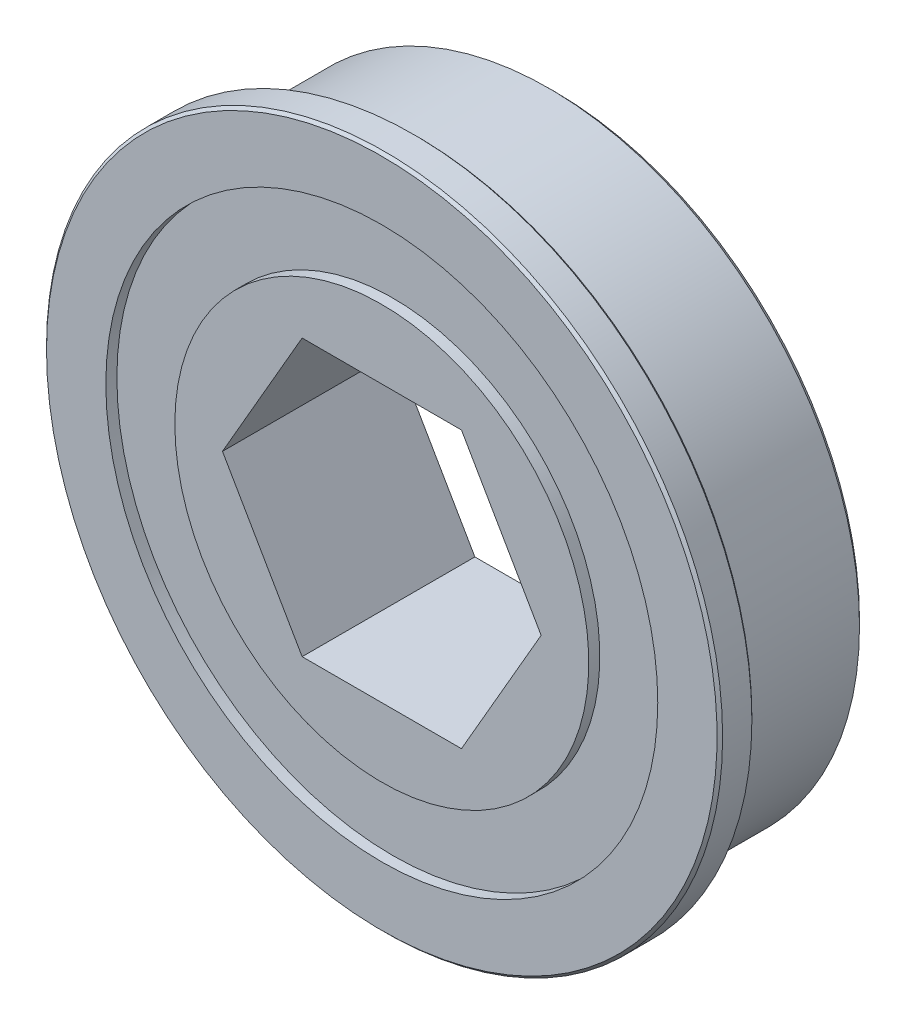
ISO-10303-21;
HEADER;
FILE_DESCRIPTION(('STEP AP214'),'2;1');
FILE_NAME('part.step','',(''),(''),'','','');
FILE_SCHEMA(('AUTOMOTIVE_DESIGN { 1 0 10303 214 1 1 1 1 }'));
ENDSEC;
DATA;
#1=APPLICATION_CONTEXT('core data for automotive mechanical design processes');
#2=APPLICATION_PROTOCOL_DEFINITION('international standard','automotive_design',2000,#1);
#3=PRODUCT_CONTEXT('',#1,'mechanical');
#4=PRODUCT('Part','Part','',(#3));
#5=PRODUCT_RELATED_PRODUCT_CATEGORY('part','',(#4));
#6=PRODUCT_DEFINITION_FORMATION('','',#4);
#7=PRODUCT_DEFINITION_CONTEXT('part definition',#1,'design');
#8=PRODUCT_DEFINITION('design','',#6,#7);
#9=PRODUCT_DEFINITION_SHAPE('','',#8);
#10=(LENGTH_UNIT() NAMED_UNIT(*) SI_UNIT(.MILLI.,.METRE.));
#11=(NAMED_UNIT(*) PLANE_ANGLE_UNIT() SI_UNIT($,.RADIAN.));
#12=(NAMED_UNIT(*) SI_UNIT($,.STERADIAN.) SOLID_ANGLE_UNIT());
#13=UNCERTAINTY_MEASURE_WITH_UNIT(LENGTH_MEASURE(1.E-05),#10,'distance_accuracy_value','');
#14=(GEOMETRIC_REPRESENTATION_CONTEXT(3) GLOBAL_UNCERTAINTY_ASSIGNED_CONTEXT((#13)) GLOBAL_UNIT_ASSIGNED_CONTEXT((#10,
#11,#12)) REPRESENTATION_CONTEXT('',''));
#15=CARTESIAN_POINT('',(0.,0.,0.));
#16=DIRECTION('',(0.,0.,1.));
#17=DIRECTION('',(1.,0.,0.));
#18=AXIS2_PLACEMENT_3D('',#15,#16,#17);
#19=CARTESIAN_POINT('',(7.33234841870825,0.,-3.975));
#20=DIRECTION('',(0.866025403784439,0.5,0.));
#21=DIRECTION('',(0.,0.,-1.));
#22=AXIS2_PLACEMENT_3D('',#19,#20,#21);
#23=PLANE('',#22);
#24=DIRECTION('',(-0.5,0.866025403784439,0.));
#25=VECTOR('',#24,1.);
#26=CARTESIAN_POINT('',(7.33234841870825,0.,3.975));
#27=LINE('',#26,#25);
#28=CARTESIAN_POINT('',(7.33234841870825,0.,3.975));
#29=VERTEX_POINT('',#28);
#30=CARTESIAN_POINT('',(3.66617420935412,6.35,3.975));
#31=VERTEX_POINT('',#30);
#32=EDGE_CURVE('E191',#29,#31,#27,.T.);
#33=ORIENTED_EDGE('',*,*,#32,.T.);
#34=DIRECTION('',(0.,0.,1.));
#35=VECTOR('',#34,1.);
#36=CARTESIAN_POINT('',(3.66617420935412,6.35,-3.975));
#37=LINE('',#36,#35);
#38=CARTESIAN_POINT('',(3.66617420935412,6.35,-3.975));
#39=VERTEX_POINT('',#38);
#40=EDGE_CURVE('E12',#39,#31,#37,.T.);
#41=ORIENTED_EDGE('',*,*,#40,.F.);
#42=DIRECTION('',(-0.5,0.866025403784439,0.));
#43=VECTOR('',#42,1.);
#44=CARTESIAN_POINT('',(7.33234841870825,0.,-3.975));
#45=LINE('',#44,#43);
#46=CARTESIAN_POINT('',(7.33234841870825,0.,-3.975));
#47=VERTEX_POINT('',#46);
#48=EDGE_CURVE('E116',#47,#39,#45,.T.);
#49=ORIENTED_EDGE('',*,*,#48,.F.);
#50=DIRECTION('',(0.,0.,1.));
#51=VECTOR('',#50,1.);
#52=CARTESIAN_POINT('',(7.33234841870825,0.,-3.975));
#53=LINE('',#52,#51);
#54=EDGE_CURVE('E91',#47,#29,#53,.T.);
#55=ORIENTED_EDGE('',*,*,#54,.T.);
#56=EDGE_LOOP('',(#33,#41,#49,#55));
#57=FACE_BOUND('',#56,.T.);
#58=ADVANCED_FACE('F20',(#57),#23,.F.);
#59=CARTESIAN_POINT('',(3.66617420935412,6.35,-3.975));
#60=DIRECTION('',(0.,1.,0.));
#61=DIRECTION('',(1.,0.,0.));
#62=AXIS2_PLACEMENT_3D('',#59,#60,#61);
#63=PLANE('',#62);
#64=DIRECTION('',(-1.,0.,0.));
#65=VECTOR('',#64,1.);
#66=CARTESIAN_POINT('',(3.66617420935412,6.35,3.975));
#67=LINE('',#66,#65);
#68=CARTESIAN_POINT('',(-3.66617420935412,6.35,3.975));
#69=VERTEX_POINT('',#68);
#70=EDGE_CURVE('E124',#31,#69,#67,.T.);
#71=ORIENTED_EDGE('',*,*,#70,.T.);
#72=DIRECTION('',(0.,0.,1.));
#73=VECTOR('',#72,1.);
#74=CARTESIAN_POINT('',(-3.66617420935412,6.35,-3.975));
#75=LINE('',#74,#73);
#76=CARTESIAN_POINT('',(-3.66617420935412,6.35,-3.975));
#77=VERTEX_POINT('',#76);
#78=EDGE_CURVE('E28',#77,#69,#75,.T.);
#79=ORIENTED_EDGE('',*,*,#78,.F.);
#80=DIRECTION('',(-1.,0.,0.));
#81=VECTOR('',#80,1.);
#82=CARTESIAN_POINT('',(3.66617420935412,6.35,-3.975));
#83=LINE('',#82,#81);
#84=EDGE_CURVE('E211',#39,#77,#83,.T.);
#85=ORIENTED_EDGE('',*,*,#84,.F.);
#86=ORIENTED_EDGE('',*,*,#40,.T.);
#87=EDGE_LOOP('',(#71,#79,#85,#86));
#88=FACE_BOUND('',#87,.T.);
#89=ADVANCED_FACE('F238',(#88),#63,.F.);
#90=CARTESIAN_POINT('',(-3.66617420935412,6.35,-3.975));
#91=DIRECTION('',(-0.866025403784439,0.5,0.));
#92=DIRECTION('',(0.,0.,1.));
#93=AXIS2_PLACEMENT_3D('',#90,#91,#92);
#94=PLANE('',#93);
#95=DIRECTION('',(-0.5,-0.866025403784439,0.));
#96=VECTOR('',#95,1.);
#97=CARTESIAN_POINT('',(-3.66617420935412,6.35,3.975));
#98=LINE('',#97,#96);
#99=CARTESIAN_POINT('',(-7.33234841870825,0.,3.975));
#100=VERTEX_POINT('',#99);
#101=EDGE_CURVE('E129',#69,#100,#98,.T.);
#102=ORIENTED_EDGE('',*,*,#101,.T.);
#103=DIRECTION('',(0.,0.,1.));
#104=VECTOR('',#103,1.);
#105=CARTESIAN_POINT('',(-7.33234841870825,0.,-3.975));
#106=LINE('',#105,#104);
#107=CARTESIAN_POINT('',(-7.33234841870825,0.,-3.975));
#108=VERTEX_POINT('',#107);
#109=EDGE_CURVE('E41',#108,#100,#106,.T.);
#110=ORIENTED_EDGE('',*,*,#109,.F.);
#111=DIRECTION('',(-0.5,-0.866025403784439,0.));
#112=VECTOR('',#111,1.);
#113=CARTESIAN_POINT('',(-3.66617420935412,6.35,-3.975));
#114=LINE('',#113,#112);
#115=EDGE_CURVE('E216',#77,#108,#114,.T.);
#116=ORIENTED_EDGE('',*,*,#115,.F.);
#117=ORIENTED_EDGE('',*,*,#78,.T.);
#118=EDGE_LOOP('',(#102,#110,#116,#117));
#119=FACE_BOUND('',#118,.T.);
#120=ADVANCED_FACE('F234',(#119),#94,.F.);
#121=CARTESIAN_POINT('',(-7.33234841870825,0.,-3.975));
#122=DIRECTION('',(-0.866025403784439,-0.5,0.));
#123=DIRECTION('',(-0.5,0.866025403784439,0.));
#124=AXIS2_PLACEMENT_3D('',#121,#122,#123);
#125=PLANE('',#124);
#126=DIRECTION('',(0.5,-0.866025403784439,0.));
#127=VECTOR('',#126,1.);
#128=CARTESIAN_POINT('',(-7.33234841870825,0.,3.975));
#129=LINE('',#128,#127);
#130=CARTESIAN_POINT('',(-3.66617420935412,-6.35,3.975));
#131=VERTEX_POINT('',#130);
#132=EDGE_CURVE('E203',#100,#131,#129,.T.);
#133=ORIENTED_EDGE('',*,*,#132,.T.);
#134=DIRECTION('',(0.,0.,1.));
#135=VECTOR('',#134,1.);
#136=CARTESIAN_POINT('',(-3.66617420935412,-6.35,-3.975));
#137=LINE('',#136,#135);
#138=CARTESIAN_POINT('',(-3.66617420935412,-6.35,-3.975));
#139=VERTEX_POINT('',#138);
#140=EDGE_CURVE('E108',#139,#131,#137,.T.);
#141=ORIENTED_EDGE('',*,*,#140,.F.);
#142=DIRECTION('',(0.5,-0.866025403784439,0.));
#143=VECTOR('',#142,1.);
#144=CARTESIAN_POINT('',(-7.33234841870825,0.,-3.975));
#145=LINE('',#144,#143);
#146=EDGE_CURVE('E122',#108,#139,#145,.T.);
#147=ORIENTED_EDGE('',*,*,#146,.F.);
#148=ORIENTED_EDGE('',*,*,#109,.T.);
#149=EDGE_LOOP('',(#133,#141,#147,#148));
#150=FACE_BOUND('',#149,.T.);
#151=ADVANCED_FACE('F666',(#150),#125,.F.);
#152=CARTESIAN_POINT('',(-3.66617420935412,-6.35,-3.975));
#153=DIRECTION('',(0.,-1.,0.));
#154=DIRECTION('',(0.,0.,-1.));
#155=AXIS2_PLACEMENT_3D('',#152,#153,#154);
#156=PLANE('',#155);
#157=DIRECTION('',(1.,0.,0.));
#158=VECTOR('',#157,1.);
#159=CARTESIAN_POINT('',(-3.66617420935412,-6.35,3.975));
#160=LINE('',#159,#158);
#161=CARTESIAN_POINT('',(3.66617420935412,-6.35,3.975));
#162=VERTEX_POINT('',#161);
#163=EDGE_CURVE('E105',#131,#162,#160,.T.);
#164=ORIENTED_EDGE('',*,*,#163,.T.);
#165=DIRECTION('',(0.,0.,1.));
#166=VECTOR('',#165,1.);
#167=CARTESIAN_POINT('',(3.66617420935412,-6.35,-3.975));
#168=LINE('',#167,#166);
#169=CARTESIAN_POINT('',(3.66617420935412,-6.35,-3.975));
#170=VERTEX_POINT('',#169);
#171=EDGE_CURVE('E100',#170,#162,#168,.T.);
#172=ORIENTED_EDGE('',*,*,#171,.F.);
#173=DIRECTION('',(1.,0.,0.));
#174=VECTOR('',#173,1.);
#175=CARTESIAN_POINT('',(-3.66617420935412,-6.35,-3.975));
#176=LINE('',#175,#174);
#177=EDGE_CURVE('E103',#139,#170,#176,.T.);
#178=ORIENTED_EDGE('',*,*,#177,.F.);
#179=ORIENTED_EDGE('',*,*,#140,.T.);
#180=EDGE_LOOP('',(#164,#172,#178,#179));
#181=FACE_BOUND('',#180,.T.);
#182=ADVANCED_FACE('F101',(#181),#156,.F.);
#183=CARTESIAN_POINT('',(3.66617420935412,-6.35,-3.975));
#184=DIRECTION('',(0.866025403784439,-0.5,0.));
#185=DIRECTION('',(0.,0.,-1.));
#186=AXIS2_PLACEMENT_3D('',#183,#184,#185);
#187=PLANE('',#186);
#188=DIRECTION('',(0.5,0.866025403784439,0.));
#189=VECTOR('',#188,1.);
#190=CARTESIAN_POINT('',(3.66617420935412,-6.35,3.975));
#191=LINE('',#190,#189);
#192=EDGE_CURVE('E195',#162,#29,#191,.T.);
#193=ORIENTED_EDGE('',*,*,#192,.T.);
#194=ORIENTED_EDGE('',*,*,#54,.F.);
#195=DIRECTION('',(0.5,0.866025403784439,0.));
#196=VECTOR('',#195,1.);
#197=CARTESIAN_POINT('',(3.66617420935412,-6.35,-3.975));
#198=LINE('',#197,#196);
#199=EDGE_CURVE('E111',#170,#47,#198,.T.);
#200=ORIENTED_EDGE('',*,*,#199,.F.);
#201=ORIENTED_EDGE('',*,*,#171,.T.);
#202=EDGE_LOOP('',(#193,#194,#200,#201));
#203=FACE_BOUND('',#202,.T.);
#204=ADVANCED_FACE('F112',(#203),#187,.F.);
#205=CARTESIAN_POINT('',(0.,0.,3.467));
#206=DIRECTION('',(0.,0.,1.));
#207=DIRECTION('',(1.,0.,0.));
#208=AXIS2_PLACEMENT_3D('',#205,#206,#207);
#209=PLANE('',#208);
#210=CARTESIAN_POINT('',(0.,0.,3.467));
#211=DIRECTION('',(0.,0.,-1.));
#212=DIRECTION('',(-1.,0.,0.));
#213=AXIS2_PLACEMENT_3D('',#210,#211,#212);
#214=CIRCLE('',#213,9.525);
#215=CARTESIAN_POINT('',(-9.525,0.,3.467));
#216=VERTEX_POINT('',#215);
#217=EDGE_CURVE('E170',#216,#216,#214,.T.);
#218=ORIENTED_EDGE('',*,*,#217,.T.);
#219=EDGE_LOOP('',(#218));
#220=FACE_BOUND('',#219,.T.);
#221=CARTESIAN_POINT('',(0.,0.,3.467));
#222=DIRECTION('',(0.,0.,-1.));
#223=DIRECTION('',(-1.,0.,0.));
#224=AXIS2_PLACEMENT_3D('',#221,#222,#223);
#225=CIRCLE('',#224,12.7);
#226=CARTESIAN_POINT('',(-12.7,0.,3.467));
#227=VERTEX_POINT('',#226);
#228=EDGE_CURVE('E152',#227,#227,#225,.T.);
#229=ORIENTED_EDGE('',*,*,#228,.F.);
#230=EDGE_LOOP('',(#229));
#231=FACE_BOUND('',#230,.T.);
#232=ADVANCED_FACE('F631',(#220,#231),#209,.T.);
#233=CARTESIAN_POINT('',(0.,0.,-3.467));
#234=DIRECTION('',(0.,0.,-1.));
#235=DIRECTION('',(0.,-1.,0.));
#236=AXIS2_PLACEMENT_3D('',#233,#234,#235);
#237=PLANE('',#236);
#238=CARTESIAN_POINT('',(0.,0.,-3.467));
#239=DIRECTION('',(0.,0.,-1.));
#240=DIRECTION('',(-1.,0.,0.));
#241=AXIS2_PLACEMENT_3D('',#238,#239,#240);
#242=CIRCLE('',#241,9.525);
#243=CARTESIAN_POINT('',(-9.525,0.,-3.467));
#244=VERTEX_POINT('',#243);
#245=EDGE_CURVE('E296',#244,#244,#242,.T.);
#246=ORIENTED_EDGE('',*,*,#245,.F.);
#247=EDGE_LOOP('',(#246));
#248=FACE_BOUND('',#247,.T.);
#249=CARTESIAN_POINT('',(0.,0.,-3.467));
#250=DIRECTION('',(0.,0.,-1.));
#251=DIRECTION('',(-1.,0.,0.));
#252=AXIS2_PLACEMENT_3D('',#249,#250,#251);
#253=CIRCLE('',#252,12.7);
#254=CARTESIAN_POINT('',(-12.7,0.,-3.467));
#255=VERTEX_POINT('',#254);
#256=EDGE_CURVE('E180',#255,#255,#253,.T.);
#257=ORIENTED_EDGE('',*,*,#256,.T.);
#258=EDGE_LOOP('',(#257));
#259=FACE_BOUND('',#258,.T.);
#260=ADVANCED_FACE('F619',(#248,#259),#237,.T.);
#261=CARTESIAN_POINT('',(0.,14.2875,2.375));
#262=DIRECTION('',(0.,0.,1.));
#263=DIRECTION('',(1.,0.,0.));
#264=AXIS2_PLACEMENT_3D('',#261,#262,#263);
#265=PLANE('',#264);
#266=CARTESIAN_POINT('',(0.,0.,2.375));
#267=DIRECTION('',(0.,0.,1.));
#268=DIRECTION('',(1.,0.,0.));
#269=AXIS2_PLACEMENT_3D('',#266,#267,#268);
#270=CIRCLE('',#269,14.1605);
#271=CARTESIAN_POINT('',(14.1605,0.,2.375));
#272=VERTEX_POINT('',#271);
#273=EDGE_CURVE('E134',#272,#272,#270,.T.);
#274=ORIENTED_EDGE('',*,*,#273,.T.);
#275=EDGE_LOOP('',(#274));
#276=FACE_BOUND('',#275,.T.);
#277=CARTESIAN_POINT('',(0.,0.,2.375));
#278=DIRECTION('',(0.,0.,-1.));
#279=DIRECTION('',(1.,0.,0.));
#280=AXIS2_PLACEMENT_3D('',#277,#278,#279);
#281=CIRCLE('',#280,15.4305);
#282=CARTESIAN_POINT('',(15.4305,0.,2.375));
#283=VERTEX_POINT('',#282);
#284=EDGE_CURVE('E335',#283,#283,#281,.T.);
#285=ORIENTED_EDGE('',*,*,#284,.T.);
#286=EDGE_LOOP('',(#285));
#287=FACE_BOUND('',#286,.T.);
#288=ADVANCED_FACE('F607',(#276,#287),#265,.F.);
#289=CARTESIAN_POINT('',(0.,14.1605,2.121));
#290=DIRECTION('',(0.,0.,-1.));
#291=DIRECTION('',(0.,-1.,0.));
#292=AXIS2_PLACEMENT_3D('',#289,#290,#291);
#293=PLANE('',#292);
#294=CARTESIAN_POINT('',(0.,0.,2.121));
#295=DIRECTION('',(0.,0.,1.));
#296=DIRECTION('',(1.,0.,0.));
#297=AXIS2_PLACEMENT_3D('',#294,#295,#296);
#298=CIRCLE('',#297,14.1605);
#299=CARTESIAN_POINT('',(14.1605,0.,2.121));
#300=VERTEX_POINT('',#299);
#301=EDGE_CURVE('E272',#300,#300,#298,.T.);
#302=ORIENTED_EDGE('',*,*,#301,.F.);
#303=EDGE_LOOP('',(#302));
#304=FACE_BOUND('',#303,.T.);
#305=CARTESIAN_POINT('',(0.,0.,2.121));
#306=DIRECTION('',(0.,0.,1.));
#307=DIRECTION('',(1.,0.,0.));
#308=AXIS2_PLACEMENT_3D('',#305,#306,#307);
#309=CIRCLE('',#308,14.2875);
#310=CARTESIAN_POINT('',(14.2875,0.,2.121));
#311=VERTEX_POINT('',#310);
#312=EDGE_CURVE('E137',#311,#311,#309,.T.);
#313=ORIENTED_EDGE('',*,*,#312,.T.);
#314=EDGE_LOOP('',(#313));
#315=FACE_BOUND('',#314,.T.);
#316=ADVANCED_FACE('F503',(#304,#315),#293,.F.);
#317=CARTESIAN_POINT('',(0.,5.08,-3.975));
#318=DIRECTION('',(0.,0.,1.));
#319=DIRECTION('',(1.,0.,0.));
#320=AXIS2_PLACEMENT_3D('',#317,#318,#319);
#321=PLANE('',#320);
#322=CARTESIAN_POINT('',(0.,0.,-3.975));
#323=DIRECTION('',(0.,0.,-1.));
#324=DIRECTION('',(-1.,0.,0.));
#325=AXIS2_PLACEMENT_3D('',#322,#323,#324);
#326=CIRCLE('',#325,12.7);
#327=CARTESIAN_POINT('',(-12.7,0.,-3.975));
#328=VERTEX_POINT('',#327);
#329=EDGE_CURVE('E278',#328,#328,#326,.T.);
#330=ORIENTED_EDGE('',*,*,#329,.F.);
#331=EDGE_LOOP('',(#330));
#332=FACE_BOUND('',#331,.T.);
#333=CARTESIAN_POINT('',(0.,0.,-3.975));
#334=DIRECTION('',(0.,0.,-1.));
#335=DIRECTION('',(1.,0.,0.));
#336=AXIS2_PLACEMENT_3D('',#333,#334,#335);
#337=CIRCLE('',#336,14.0335);
#338=CARTESIAN_POINT('',(14.0335,0.,-3.975));
#339=VERTEX_POINT('',#338);
#340=EDGE_CURVE('E323',#339,#339,#337,.T.);
#341=ORIENTED_EDGE('',*,*,#340,.T.);
#342=EDGE_LOOP('',(#341));
#343=FACE_BOUND('',#342,.T.);
#344=ADVANCED_FACE('F497',(#332,#343),#321,.F.);
#345=CARTESIAN_POINT('',(0.,15.5575,3.975));
#346=DIRECTION('',(0.,0.,-1.));
#347=DIRECTION('',(0.,-1.,0.));
#348=AXIS2_PLACEMENT_3D('',#345,#346,#347);
#349=PLANE('',#348);
#350=CARTESIAN_POINT('',(0.,0.,3.975));
#351=DIRECTION('',(0.,0.,-1.));
#352=DIRECTION('',(-1.,0.,0.));
#353=AXIS2_PLACEMENT_3D('',#350,#351,#352);
#354=CIRCLE('',#353,12.7);
#355=CARTESIAN_POINT('',(-12.7,0.,3.975));
#356=VERTEX_POINT('',#355);
#357=EDGE_CURVE('E157',#356,#356,#354,.T.);
#358=ORIENTED_EDGE('',*,*,#357,.T.);
#359=EDGE_LOOP('',(#358));
#360=FACE_BOUND('',#359,.T.);
#361=CARTESIAN_POINT('',(0.,0.,3.975));
#362=DIRECTION('',(0.,0.,1.));
#363=DIRECTION('',(-1.,0.,0.));
#364=AXIS2_PLACEMENT_3D('',#361,#362,#363);
#365=CIRCLE('',#364,15.4305);
#366=CARTESIAN_POINT('',(-15.4305,0.,3.975));
#367=VERTEX_POINT('',#366);
#368=EDGE_CURVE('E175',#367,#367,#365,.T.);
#369=ORIENTED_EDGE('',*,*,#368,.T.);
#370=EDGE_LOOP('',(#369));
#371=FACE_BOUND('',#370,.T.);
#372=ADVANCED_FACE('F502',(#360,#371),#349,.F.);
#373=CARTESIAN_POINT('',(0.,5.08,-3.975));
#374=DIRECTION('',(0.,0.,1.));
#375=DIRECTION('',(1.,0.,0.));
#376=AXIS2_PLACEMENT_3D('',#373,#374,#375);
#377=PLANE('',#376);
#378=ORIENTED_EDGE('',*,*,#177,.T.);
#379=ORIENTED_EDGE('',*,*,#199,.T.);
#380=ORIENTED_EDGE('',*,*,#48,.T.);
#381=ORIENTED_EDGE('',*,*,#84,.T.);
#382=ORIENTED_EDGE('',*,*,#115,.T.);
#383=ORIENTED_EDGE('',*,*,#146,.T.);
#384=EDGE_LOOP('',(#378,#379,#380,#381,#382,#383));
#385=FACE_BOUND('',#384,.T.);
#386=CARTESIAN_POINT('',(0.,0.,-3.975));
#387=DIRECTION('',(0.,0.,-1.));
#388=DIRECTION('',(-1.,0.,0.));
#389=AXIS2_PLACEMENT_3D('',#386,#387,#388);
#390=CIRCLE('',#389,9.525);
#391=CARTESIAN_POINT('',(-9.525,0.,-3.975));
#392=VERTEX_POINT('',#391);
#393=EDGE_CURVE('E290',#392,#392,#390,.T.);
#394=ORIENTED_EDGE('',*,*,#393,.T.);
#395=EDGE_LOOP('',(#394));
#396=FACE_BOUND('',#395,.T.);
#397=ADVANCED_FACE('F119',(#385,#396),#377,.F.);
#398=CARTESIAN_POINT('',(0.,15.5575,3.975));
#399=DIRECTION('',(0.,0.,-1.));
#400=DIRECTION('',(0.,-1.,0.));
#401=AXIS2_PLACEMENT_3D('',#398,#399,#400);
#402=PLANE('',#401);
#403=ORIENTED_EDGE('',*,*,#32,.F.);
#404=ORIENTED_EDGE('',*,*,#192,.F.);
#405=ORIENTED_EDGE('',*,*,#163,.F.);
#406=ORIENTED_EDGE('',*,*,#132,.F.);
#407=ORIENTED_EDGE('',*,*,#101,.F.);
#408=ORIENTED_EDGE('',*,*,#70,.F.);
#409=EDGE_LOOP('',(#403,#404,#405,#406,#407,#408));
#410=FACE_BOUND('',#409,.T.);
#411=CARTESIAN_POINT('',(0.,0.,3.975));
#412=DIRECTION('',(0.,0.,-1.));
#413=DIRECTION('',(-1.,0.,0.));
#414=AXIS2_PLACEMENT_3D('',#411,#412,#413);
#415=CIRCLE('',#414,9.525);
#416=CARTESIAN_POINT('',(-9.525,0.,3.975));
#417=VERTEX_POINT('',#416);
#418=EDGE_CURVE('E158',#417,#417,#415,.T.);
#419=ORIENTED_EDGE('',*,*,#418,.F.);
#420=EDGE_LOOP('',(#419));
#421=FACE_BOUND('',#420,.T.);
#422=ADVANCED_FACE('F241',(#410,#421),#402,.F.);
#423=CARTESIAN_POINT('',(0.,0.,6.18055555555556));
#424=DIRECTION('',(0.,0.,1.));
#425=DIRECTION('',(1.,0.,0.));
#426=AXIS2_PLACEMENT_3D('',#423,#424,#425);
#427=CYLINDRICAL_SURFACE('',#426,15.5575);
#428=CARTESIAN_POINT('',(0.,0.,3.848));
#429=DIRECTION('',(0.,0.,-1.));
#430=DIRECTION('',(-1.,0.,0.));
#431=AXIS2_PLACEMENT_3D('',#428,#429,#430);
#432=CIRCLE('',#431,15.5575);
#433=CARTESIAN_POINT('',(-15.5575,0.,3.848));
#434=VERTEX_POINT('',#433);
#435=EDGE_CURVE('E179',#434,#434,#432,.T.);
#436=ORIENTED_EDGE('',*,*,#435,.T.);
#437=EDGE_LOOP('',(#436));
#438=FACE_BOUND('',#437,.T.);
#439=CARTESIAN_POINT('',(0.,0.,2.502));
#440=DIRECTION('',(0.,0.,1.));
#441=DIRECTION('',(1.,0.,0.));
#442=AXIS2_PLACEMENT_3D('',#439,#440,#441);
#443=CIRCLE('',#442,15.5575);
#444=CARTESIAN_POINT('',(15.5575,0.,2.502));
#445=VERTEX_POINT('',#444);
#446=EDGE_CURVE('E329',#445,#445,#443,.T.);
#447=ORIENTED_EDGE('',*,*,#446,.T.);
#448=EDGE_LOOP('',(#447));
#449=FACE_BOUND('',#448,.T.);
#450=ADVANCED_FACE('F529',(#438,#449),#427,.T.);
#451=CARTESIAN_POINT('',(0.,0.,6.18055555555556));
#452=DIRECTION('',(0.,0.,1.));
#453=DIRECTION('',(1.,0.,0.));
#454=AXIS2_PLACEMENT_3D('',#451,#452,#453);
#455=CYLINDRICAL_SURFACE('',#454,14.2875);
#456=ORIENTED_EDGE('',*,*,#312,.F.);
#457=EDGE_LOOP('',(#456));
#458=FACE_BOUND('',#457,.T.);
#459=CARTESIAN_POINT('',(0.,0.,-3.721));
#460=DIRECTION('',(0.,0.,1.));
#461=DIRECTION('',(1.,0.,0.));
#462=AXIS2_PLACEMENT_3D('',#459,#460,#461);
#463=CIRCLE('',#462,14.2875);
#464=CARTESIAN_POINT('',(14.2875,0.,-3.721));
#465=VERTEX_POINT('',#464);
#466=EDGE_CURVE('E149',#465,#465,#463,.T.);
#467=ORIENTED_EDGE('',*,*,#466,.T.);
#468=EDGE_LOOP('',(#467));
#469=FACE_BOUND('',#468,.T.);
#470=ADVANCED_FACE('F454',(#458,#469),#455,.T.);
#471=CARTESIAN_POINT('',(0.,0.,6.18055555555556));
#472=DIRECTION('',(0.,0.,1.));
#473=DIRECTION('',(1.,0.,0.));
#474=AXIS2_PLACEMENT_3D('',#471,#472,#473);
#475=CYLINDRICAL_SURFACE('',#474,14.1605);
#476=ORIENTED_EDGE('',*,*,#273,.F.);
#477=EDGE_LOOP('',(#476));
#478=FACE_BOUND('',#477,.T.);
#479=ORIENTED_EDGE('',*,*,#301,.T.);
#480=EDGE_LOOP('',(#479));
#481=FACE_BOUND('',#480,.T.);
#482=ADVANCED_FACE('F448',(#478,#481),#475,.T.);
#483=CARTESIAN_POINT('',(0.,0.,-3.467));
#484=DIRECTION('',(0.,0.,-1.));
#485=DIRECTION('',(-1.,0.,0.));
#486=AXIS2_PLACEMENT_3D('',#483,#484,#485);
#487=CYLINDRICAL_SURFACE('',#486,12.7);
#488=ORIENTED_EDGE('',*,*,#329,.T.);
#489=EDGE_LOOP('',(#488));
#490=FACE_BOUND('',#489,.T.);
#491=ORIENTED_EDGE('',*,*,#256,.F.);
#492=EDGE_LOOP('',(#491));
#493=FACE_BOUND('',#492,.T.);
#494=ADVANCED_FACE('F453',(#490,#493),#487,.F.);
#495=CARTESIAN_POINT('',(0.,0.,-3.467));
#496=DIRECTION('',(0.,0.,-1.));
#497=DIRECTION('',(-1.,0.,0.));
#498=AXIS2_PLACEMENT_3D('',#495,#496,#497);
#499=CYLINDRICAL_SURFACE('',#498,9.525);
#500=ORIENTED_EDGE('',*,*,#393,.F.);
#501=EDGE_LOOP('',(#500));
#502=FACE_BOUND('',#501,.T.);
#503=ORIENTED_EDGE('',*,*,#245,.T.);
#504=EDGE_LOOP('',(#503));
#505=FACE_BOUND('',#504,.T.);
#506=ADVANCED_FACE('F551',(#502,#505),#499,.T.);
#507=CARTESIAN_POINT('',(0.,0.,3.467));
#508=DIRECTION('',(0.,0.,1.));
#509=DIRECTION('',(1.,0.,0.));
#510=AXIS2_PLACEMENT_3D('',#507,#508,#509);
#511=CYLINDRICAL_SURFACE('',#510,12.7);
#512=ORIENTED_EDGE('',*,*,#357,.F.);
#513=EDGE_LOOP('',(#512));
#514=FACE_BOUND('',#513,.T.);
#515=ORIENTED_EDGE('',*,*,#228,.T.);
#516=EDGE_LOOP('',(#515));
#517=FACE_BOUND('',#516,.T.);
#518=ADVANCED_FACE('F517',(#514,#517),#511,.F.);
#519=CARTESIAN_POINT('',(0.,0.,3.467));
#520=DIRECTION('',(0.,0.,1.));
#521=DIRECTION('',(1.,0.,0.));
#522=AXIS2_PLACEMENT_3D('',#519,#520,#521);
#523=CYLINDRICAL_SURFACE('',#522,9.525);
#524=ORIENTED_EDGE('',*,*,#418,.T.);
#525=EDGE_LOOP('',(#524));
#526=FACE_BOUND('',#525,.T.);
#527=ORIENTED_EDGE('',*,*,#217,.F.);
#528=EDGE_LOOP('',(#527));
#529=FACE_BOUND('',#528,.T.);
#530=ADVANCED_FACE('F489',(#526,#529),#523,.T.);
#531=CARTESIAN_POINT('',(0.,0.,-3.721));
#532=DIRECTION('',(0.,0.,1.));
#533=DIRECTION('',(1.,0.,0.));
#534=AXIS2_PLACEMENT_3D('',#531,#532,#533);
#535=CONICAL_SURFACE('',#534,14.2875,0.785398163397445);
#536=ORIENTED_EDGE('',*,*,#466,.F.);
#537=EDGE_LOOP('',(#536));
#538=FACE_BOUND('',#537,.T.);
#539=ORIENTED_EDGE('',*,*,#340,.F.);
#540=EDGE_LOOP('',(#539));
#541=FACE_BOUND('',#540,.T.);
#542=ADVANCED_FACE('F478',(#538,#541),#535,.T.);
#543=CARTESIAN_POINT('',(0.,0.,2.502));
#544=DIRECTION('',(0.,0.,1.));
#545=DIRECTION('',(1.,0.,0.));
#546=AXIS2_PLACEMENT_3D('',#543,#544,#545);
#547=CONICAL_SURFACE('',#546,15.5575,0.785398163397442);
#548=ORIENTED_EDGE('',*,*,#446,.F.);
#549=EDGE_LOOP('',(#548));
#550=FACE_BOUND('',#549,.T.);
#551=ORIENTED_EDGE('',*,*,#284,.F.);
#552=EDGE_LOOP('',(#551));
#553=FACE_BOUND('',#552,.T.);
#554=ADVANCED_FACE('F467',(#550,#553),#547,.T.);
#555=CARTESIAN_POINT('',(0.,0.,3.975));
#556=DIRECTION('',(0.,0.,-1.));
#557=DIRECTION('',(-1.,0.,0.));
#558=AXIS2_PLACEMENT_3D('',#555,#556,#557);
#559=CONICAL_SURFACE('',#558,15.4305,0.785398163397469);
#560=ORIENTED_EDGE('',*,*,#435,.F.);
#561=EDGE_LOOP('',(#560));
#562=FACE_BOUND('',#561,.T.);
#563=ORIENTED_EDGE('',*,*,#368,.F.);
#564=EDGE_LOOP('',(#563));
#565=FACE_BOUND('',#564,.T.);
#566=ADVANCED_FACE('F463',(#562,#565),#559,.T.);
#567=CLOSED_SHELL('',(#58,#89,#120,#151,#182,#204,#232,#260,#288,#316,#344,#372,#397,#422,#450,
#470,#482,#494,#506,#518,#530,#542,#554,#566));
#568=MANIFOLD_SOLID_BREP('B1',#567);
#569=ADVANCED_BREP_SHAPE_REPRESENTATION('',(#18,#568),#14);
#570=SHAPE_DEFINITION_REPRESENTATION(#9,#569);
ENDSEC;
END-ISO-10303-21;
